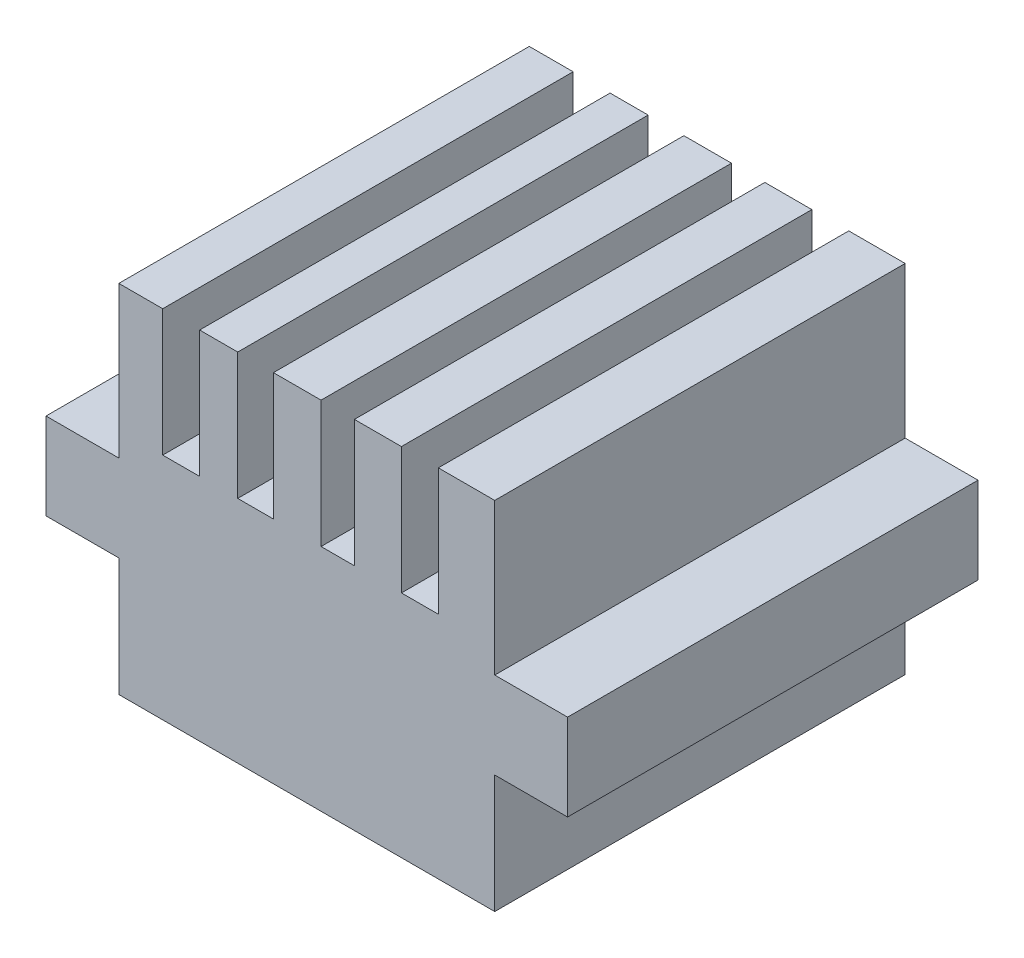
ISO-10303-21;
HEADER;
FILE_DESCRIPTION(('STEP AP214'),'2;1');
FILE_NAME('part.step','',(''),(''),'','','');
FILE_SCHEMA(('AUTOMOTIVE_DESIGN { 1 0 10303 214 1 1 1 1 }'));
ENDSEC;
DATA;
#1=APPLICATION_CONTEXT('core data for automotive mechanical design processes');
#2=APPLICATION_PROTOCOL_DEFINITION('international standard','automotive_design',2000,#1);
#3=PRODUCT_CONTEXT('',#1,'mechanical');
#4=PRODUCT('Part','Part','',(#3));
#5=PRODUCT_RELATED_PRODUCT_CATEGORY('part','',(#4));
#6=PRODUCT_DEFINITION_FORMATION('','',#4);
#7=PRODUCT_DEFINITION_CONTEXT('part definition',#1,'design');
#8=PRODUCT_DEFINITION('design','',#6,#7);
#9=PRODUCT_DEFINITION_SHAPE('','',#8);
#10=(LENGTH_UNIT() NAMED_UNIT(*) SI_UNIT(.MILLI.,.METRE.));
#11=(NAMED_UNIT(*) PLANE_ANGLE_UNIT() SI_UNIT($,.RADIAN.));
#12=(NAMED_UNIT(*) SI_UNIT($,.STERADIAN.) SOLID_ANGLE_UNIT());
#13=UNCERTAINTY_MEASURE_WITH_UNIT(LENGTH_MEASURE(1.E-05),#10,'distance_accuracy_value','');
#14=(GEOMETRIC_REPRESENTATION_CONTEXT(3) GLOBAL_UNCERTAINTY_ASSIGNED_CONTEXT((#13)) GLOBAL_UNIT_ASSIGNED_CONTEXT((#10,
#11,#12)) REPRESENTATION_CONTEXT('',''));
#15=CARTESIAN_POINT('',(0.,0.,0.));
#16=DIRECTION('',(0.,0.,1.));
#17=DIRECTION('',(1.,0.,0.));
#18=AXIS2_PLACEMENT_3D('',#15,#16,#17);
#19=CARTESIAN_POINT('',(28.85,17.6,0.));
#20=DIRECTION('',(-1.,0.,0.));
#21=DIRECTION('',(0.,0.,1.));
#22=AXIS2_PLACEMENT_3D('',#19,#20,#21);
#23=PLANE('',#22);
#24=DIRECTION('',(0.,0.,1.));
#25=VECTOR('',#24,1.);
#26=CARTESIAN_POINT('',(28.85,15.72,0.));
#27=LINE('',#26,#25);
#28=CARTESIAN_POINT('',(28.85,15.72,-31.5));
#29=VERTEX_POINT('',#28);
#30=CARTESIAN_POINT('',(28.85,15.72,0.));
#31=VERTEX_POINT('',#30);
#32=EDGE_CURVE('E240',#29,#31,#27,.T.);
#33=ORIENTED_EDGE('',*,*,#32,.F.);
#34=DIRECTION('',(0.,-1.,0.));
#35=VECTOR('',#34,1.);
#36=CARTESIAN_POINT('',(28.85,17.6,-31.5));
#37=LINE('',#36,#35);
#38=CARTESIAN_POINT('',(28.85,27.33,-31.5));
#39=VERTEX_POINT('',#38);
#40=EDGE_CURVE('E419',#39,#29,#37,.T.);
#41=ORIENTED_EDGE('',*,*,#40,.F.);
#42=DIRECTION('',(0.,0.,-1.));
#43=VECTOR('',#42,1.);
#44=CARTESIAN_POINT('',(28.85,27.33,-31.5));
#45=LINE('',#44,#43);
#46=CARTESIAN_POINT('',(28.85,27.33,0.));
#47=VERTEX_POINT('',#46);
#48=EDGE_CURVE('E369',#47,#39,#45,.T.);
#49=ORIENTED_EDGE('',*,*,#48,.F.);
#50=DIRECTION('',(0.,-1.,0.));
#51=VECTOR('',#50,1.);
#52=CARTESIAN_POINT('',(28.85,17.6,0.));
#53=LINE('',#52,#51);
#54=EDGE_CURVE('E59',#47,#31,#53,.T.);
#55=ORIENTED_EDGE('',*,*,#54,.T.);
#56=EDGE_LOOP('',(#33,#41,#49,#55));
#57=FACE_BOUND('',#56,.T.);
#58=ADVANCED_FACE('F36',(#57),#23,.F.);
#59=DIRECTION('',(0.,0.,-1.));
#60=VECTOR('',#59,1.);
#61=CARTESIAN_POINT('',(28.85,9.08,0.));
#62=LINE('',#61,#60);
#63=CARTESIAN_POINT('',(28.85,9.08,0.));
#64=VERTEX_POINT('',#63);
#65=CARTESIAN_POINT('',(28.85,9.08,-31.5));
#66=VERTEX_POINT('',#65);
#67=EDGE_CURVE('E51',#64,#66,#62,.T.);
#68=ORIENTED_EDGE('',*,*,#67,.F.);
#69=CARTESIAN_POINT('',(28.85,0.,0.));
#70=VERTEX_POINT('',#69);
#71=EDGE_CURVE('E244',#64,#70,#53,.T.);
#72=ORIENTED_EDGE('',*,*,#71,.T.);
#73=DIRECTION('',(0.,0.,-1.));
#74=VECTOR('',#73,1.);
#75=CARTESIAN_POINT('',(28.85,0.,0.));
#76=LINE('',#75,#74);
#77=CARTESIAN_POINT('',(28.85,0.,-31.5));
#78=VERTEX_POINT('',#77);
#79=EDGE_CURVE('E410',#70,#78,#76,.T.);
#80=ORIENTED_EDGE('',*,*,#79,.T.);
#81=EDGE_CURVE('E418',#66,#78,#37,.T.);
#82=ORIENTED_EDGE('',*,*,#81,.F.);
#83=EDGE_LOOP('',(#68,#72,#80,#82));
#84=FACE_BOUND('',#83,.T.);
#85=ADVANCED_FACE('F421',(#84),#23,.F.);
#86=CARTESIAN_POINT('',(0.,17.6,0.));
#87=DIRECTION('',(1.,0.,0.));
#88=DIRECTION('',(0.,0.,-1.));
#89=AXIS2_PLACEMENT_3D('',#86,#87,#88);
#90=PLANE('',#89);
#91=DIRECTION('',(0.,0.,-1.));
#92=VECTOR('',#91,1.);
#93=CARTESIAN_POINT('',(0.,15.72,-31.5));
#94=LINE('',#93,#92);
#95=CARTESIAN_POINT('',(0.,15.72,0.));
#96=VERTEX_POINT('',#95);
#97=CARTESIAN_POINT('',(0.,15.72,-31.5));
#98=VERTEX_POINT('',#97);
#99=EDGE_CURVE('E248',#96,#98,#94,.T.);
#100=ORIENTED_EDGE('',*,*,#99,.F.);
#101=DIRECTION('',(0.,-1.,0.));
#102=VECTOR('',#101,1.);
#103=CARTESIAN_POINT('',(0.,17.6,0.));
#104=LINE('',#103,#102);
#105=CARTESIAN_POINT('',(0.,27.33,0.));
#106=VERTEX_POINT('',#105);
#107=EDGE_CURVE('E11',#106,#96,#104,.T.);
#108=ORIENTED_EDGE('',*,*,#107,.F.);
#109=DIRECTION('',(0.,0.,1.));
#110=VECTOR('',#109,1.);
#111=CARTESIAN_POINT('',(0.,27.33,-31.5));
#112=LINE('',#111,#110);
#113=CARTESIAN_POINT('',(0.,27.33,-31.5));
#114=VERTEX_POINT('',#113);
#115=EDGE_CURVE('E378',#114,#106,#112,.T.);
#116=ORIENTED_EDGE('',*,*,#115,.F.);
#117=DIRECTION('',(0.,-1.,0.));
#118=VECTOR('',#117,1.);
#119=CARTESIAN_POINT('',(0.,17.6,-31.5));
#120=LINE('',#119,#118);
#121=EDGE_CURVE('E416',#114,#98,#120,.T.);
#122=ORIENTED_EDGE('',*,*,#121,.T.);
#123=EDGE_LOOP('',(#100,#108,#116,#122));
#124=FACE_BOUND('',#123,.T.);
#125=ADVANCED_FACE('F38',(#124),#90,.F.);
#126=DIRECTION('',(0.,0.,1.));
#127=VECTOR('',#126,1.);
#128=CARTESIAN_POINT('',(0.,9.08,-31.5));
#129=LINE('',#128,#127);
#130=CARTESIAN_POINT('',(0.,9.08,-31.5));
#131=VERTEX_POINT('',#130);
#132=CARTESIAN_POINT('',(0.,9.08,0.));
#133=VERTEX_POINT('',#132);
#134=EDGE_CURVE('E245',#131,#133,#129,.T.);
#135=ORIENTED_EDGE('',*,*,#134,.F.);
#136=CARTESIAN_POINT('',(0.,0.,-31.5));
#137=VERTEX_POINT('',#136);
#138=EDGE_CURVE('E404',#131,#137,#120,.T.);
#139=ORIENTED_EDGE('',*,*,#138,.T.);
#140=DIRECTION('',(0.,0.,1.));
#141=VECTOR('',#140,1.);
#142=CARTESIAN_POINT('',(0.,0.,0.));
#143=LINE('',#142,#141);
#144=CARTESIAN_POINT('',(0.,0.,0.));
#145=VERTEX_POINT('',#144);
#146=EDGE_CURVE('E396',#137,#145,#143,.T.);
#147=ORIENTED_EDGE('',*,*,#146,.T.);
#148=EDGE_CURVE('E44',#133,#145,#104,.T.);
#149=ORIENTED_EDGE('',*,*,#148,.F.);
#150=EDGE_LOOP('',(#135,#139,#147,#149));
#151=FACE_BOUND('',#150,.T.);
#152=ADVANCED_FACE('F533',(#151),#90,.F.);
#153=CARTESIAN_POINT('',(0.,17.6,0.));
#154=DIRECTION('',(0.,-1.,0.));
#155=DIRECTION('',(0.,0.,-1.));
#156=AXIS2_PLACEMENT_3D('',#153,#154,#155);
#157=PLANE('',#156);
#158=DIRECTION('',(0.,0.,-1.));
#159=VECTOR('',#158,1.);
#160=CARTESIAN_POINT('',(9.12517133066819,17.6,-31.5));
#161=LINE('',#160,#159);
#162=CARTESIAN_POINT('',(9.12517133066819,17.6,0.));
#163=VERTEX_POINT('',#162);
#164=CARTESIAN_POINT('',(9.12517133066819,17.6,-31.5));
#165=VERTEX_POINT('',#164);
#166=EDGE_CURVE('E293',#163,#165,#161,.T.);
#167=ORIENTED_EDGE('',*,*,#166,.F.);
#168=DIRECTION('',(1.,0.,0.));
#169=VECTOR('',#168,1.);
#170=CARTESIAN_POINT('',(0.,17.6,0.));
#171=LINE('',#170,#169);
#172=CARTESIAN_POINT('',(11.8664620217019,17.6,0.));
#173=VERTEX_POINT('',#172);
#174=EDGE_CURVE('E400',#163,#173,#171,.T.);
#175=ORIENTED_EDGE('',*,*,#174,.T.);
#176=DIRECTION('',(0.,0.,1.));
#177=VECTOR('',#176,1.);
#178=CARTESIAN_POINT('',(11.8664620217019,17.6,-31.5));
#179=LINE('',#178,#177);
#180=CARTESIAN_POINT('',(11.8664620217019,17.6,-31.5));
#181=VERTEX_POINT('',#180);
#182=EDGE_CURVE('E317',#181,#173,#179,.T.);
#183=ORIENTED_EDGE('',*,*,#182,.F.);
#184=DIRECTION('',(-1.,0.,0.));
#185=VECTOR('',#184,1.);
#186=CARTESIAN_POINT('',(0.,17.6,-31.5));
#187=LINE('',#186,#185);
#188=EDGE_CURVE('E476',#181,#165,#187,.T.);
#189=ORIENTED_EDGE('',*,*,#188,.T.);
#190=EDGE_LOOP('',(#167,#175,#183,#189));
#191=FACE_BOUND('',#190,.T.);
#192=ADVANCED_FACE('F463',(#191),#157,.F.);
#193=DIRECTION('',(0.,0.,1.));
#194=VECTOR('',#193,1.);
#195=CARTESIAN_POINT('',(6.20112792689892,17.6,-31.5));
#196=LINE('',#195,#194);
#197=CARTESIAN_POINT('',(6.20112792689892,17.6,-31.5));
#198=VERTEX_POINT('',#197);
#199=CARTESIAN_POINT('',(6.20112792689892,17.6,0.));
#200=VERTEX_POINT('',#199);
#201=EDGE_CURVE('E290',#198,#200,#196,.T.);
#202=ORIENTED_EDGE('',*,*,#201,.F.);
#203=CARTESIAN_POINT('',(3.36846087949743,17.6,-31.5));
#204=VERTEX_POINT('',#203);
#205=EDGE_CURVE('E399',#198,#204,#187,.T.);
#206=ORIENTED_EDGE('',*,*,#205,.T.);
#207=DIRECTION('',(0.,0.,-1.));
#208=VECTOR('',#207,1.);
#209=CARTESIAN_POINT('',(3.36846087949743,17.6,-31.5));
#210=LINE('',#209,#208);
#211=CARTESIAN_POINT('',(3.36846087949743,17.6,0.));
#212=VERTEX_POINT('',#211);
#213=EDGE_CURVE('E368',#212,#204,#210,.T.);
#214=ORIENTED_EDGE('',*,*,#213,.F.);
#215=EDGE_CURVE('E397',#212,#200,#171,.T.);
#216=ORIENTED_EDGE('',*,*,#215,.T.);
#217=EDGE_LOOP('',(#202,#206,#214,#216));
#218=FACE_BOUND('',#217,.T.);
#219=ADVANCED_FACE('F480',(#218),#157,.F.);
#220=DIRECTION('',(0.,0.,-1.));
#221=VECTOR('',#220,1.);
#222=CARTESIAN_POINT('',(15.5215162764135,17.6,-31.5));
#223=LINE('',#222,#221);
#224=CARTESIAN_POINT('',(15.5215162764135,17.6,0.));
#225=VERTEX_POINT('',#224);
#226=CARTESIAN_POINT('',(15.5215162764135,17.6,-31.5));
#227=VERTEX_POINT('',#226);
#228=EDGE_CURVE('E320',#225,#227,#223,.T.);
#229=ORIENTED_EDGE('',*,*,#228,.F.);
#230=CARTESIAN_POINT('',(18.0800542547116,17.6,0.));
#231=VERTEX_POINT('',#230);
#232=EDGE_CURVE('E456',#225,#231,#171,.T.);
#233=ORIENTED_EDGE('',*,*,#232,.T.);
#234=DIRECTION('',(0.,0.,1.));
#235=VECTOR('',#234,1.);
#236=CARTESIAN_POINT('',(18.0800542547116,17.6,-31.5));
#237=LINE('',#236,#235);
#238=CARTESIAN_POINT('',(18.0800542547116,17.6,-31.5));
#239=VERTEX_POINT('',#238);
#240=EDGE_CURVE('E344',#239,#231,#237,.T.);
#241=ORIENTED_EDGE('',*,*,#240,.F.);
#242=EDGE_CURVE('E405',#239,#227,#187,.T.);
#243=ORIENTED_EDGE('',*,*,#242,.T.);
#244=EDGE_LOOP('',(#229,#233,#241,#243));
#245=FACE_BOUND('',#244,.T.);
#246=ADVANCED_FACE('F526',(#245),#157,.F.);
#247=DIRECTION('',(0.,0.,-1.));
#248=VECTOR('',#247,1.);
#249=CARTESIAN_POINT('',(21.6894203312393,17.6,-31.5));
#250=LINE('',#249,#248);
#251=CARTESIAN_POINT('',(21.6894203312393,17.6,0.));
#252=VERTEX_POINT('',#251);
#253=CARTESIAN_POINT('',(21.6894203312393,17.6,-31.5));
#254=VERTEX_POINT('',#253);
#255=EDGE_CURVE('E347',#252,#254,#250,.T.);
#256=ORIENTED_EDGE('',*,*,#255,.F.);
#257=CARTESIAN_POINT('',(24.5220873786408,17.6,0.));
#258=VERTEX_POINT('',#257);
#259=EDGE_CURVE('E401',#252,#258,#171,.T.);
#260=ORIENTED_EDGE('',*,*,#259,.T.);
#261=DIRECTION('',(0.,0.,1.));
#262=VECTOR('',#261,1.);
#263=CARTESIAN_POINT('',(24.5220873786408,17.6,-31.5));
#264=LINE('',#263,#262);
#265=CARTESIAN_POINT('',(24.5220873786408,17.6,-31.5));
#266=VERTEX_POINT('',#265);
#267=EDGE_CURVE('E365',#266,#258,#264,.T.);
#268=ORIENTED_EDGE('',*,*,#267,.F.);
#269=EDGE_CURVE('E402',#266,#254,#187,.T.);
#270=ORIENTED_EDGE('',*,*,#269,.T.);
#271=EDGE_LOOP('',(#256,#260,#268,#270));
#272=FACE_BOUND('',#271,.T.);
#273=ADVANCED_FACE('F455',(#272),#157,.F.);
#274=CARTESIAN_POINT('',(0.,17.6,0.));
#275=DIRECTION('',(0.,0.,-1.));
#276=DIRECTION('',(-1.,0.,0.));
#277=AXIS2_PLACEMENT_3D('',#274,#275,#276);
#278=PLANE('',#277);
#279=DIRECTION('',(1.,0.,0.));
#280=VECTOR('',#279,1.);
#281=CARTESIAN_POINT('',(0.,0.,0.));
#282=LINE('',#281,#280);
#283=EDGE_CURVE('E408',#145,#70,#282,.T.);
#284=ORIENTED_EDGE('',*,*,#283,.T.);
#285=ORIENTED_EDGE('',*,*,#71,.F.);
#286=DIRECTION('',(-1.,0.,0.));
#287=VECTOR('',#286,1.);
#288=CARTESIAN_POINT('',(34.44,9.08,0.));
#289=LINE('',#288,#287);
#290=CARTESIAN_POINT('',(34.44,9.08,0.));
#291=VERTEX_POINT('',#290);
#292=EDGE_CURVE('E225',#291,#64,#289,.T.);
#293=ORIENTED_EDGE('',*,*,#292,.F.);
#294=DIRECTION('',(0.,-1.,0.));
#295=VECTOR('',#294,1.);
#296=CARTESIAN_POINT('',(34.44,15.72,0.));
#297=LINE('',#296,#295);
#298=CARTESIAN_POINT('',(34.44,15.72,0.));
#299=VERTEX_POINT('',#298);
#300=EDGE_CURVE('E231',#299,#291,#297,.T.);
#301=ORIENTED_EDGE('',*,*,#300,.F.);
#302=DIRECTION('',(-1.,0.,0.));
#303=VECTOR('',#302,1.);
#304=CARTESIAN_POINT('',(34.44,15.72,0.));
#305=LINE('',#304,#303);
#306=EDGE_CURVE('E437',#299,#31,#305,.T.);
#307=ORIENTED_EDGE('',*,*,#306,.T.);
#308=ORIENTED_EDGE('',*,*,#54,.F.);
#309=DIRECTION('',(1.,0.,0.));
#310=VECTOR('',#309,1.);
#311=CARTESIAN_POINT('',(28.85,27.33,0.));
#312=LINE('',#311,#310);
#313=CARTESIAN_POINT('',(24.5220873786408,27.33,0.));
#314=VERTEX_POINT('',#313);
#315=EDGE_CURVE('E364',#314,#47,#312,.T.);
#316=ORIENTED_EDGE('',*,*,#315,.F.);
#317=DIRECTION('',(0.,-1.,0.));
#318=VECTOR('',#317,1.);
#319=CARTESIAN_POINT('',(24.5220873786408,27.33,0.));
#320=LINE('',#319,#318);
#321=EDGE_CURVE('E361',#314,#258,#320,.T.);
#322=ORIENTED_EDGE('',*,*,#321,.T.);
#323=ORIENTED_EDGE('',*,*,#259,.F.);
#324=DIRECTION('',(0.,-1.,0.));
#325=VECTOR('',#324,1.);
#326=CARTESIAN_POINT('',(21.6894203312393,27.33,0.));
#327=LINE('',#326,#325);
#328=CARTESIAN_POINT('',(21.6894203312393,27.33,0.));
#329=VERTEX_POINT('',#328);
#330=EDGE_CURVE('E340',#329,#252,#327,.T.);
#331=ORIENTED_EDGE('',*,*,#330,.F.);
#332=DIRECTION('',(1.,0.,0.));
#333=VECTOR('',#332,1.);
#334=CARTESIAN_POINT('',(21.6894203312393,27.33,0.));
#335=LINE('',#334,#333);
#336=CARTESIAN_POINT('',(18.0800542547116,27.33,0.));
#337=VERTEX_POINT('',#336);
#338=EDGE_CURVE('E343',#337,#329,#335,.T.);
#339=ORIENTED_EDGE('',*,*,#338,.F.);
#340=DIRECTION('',(0.,-1.,0.));
#341=VECTOR('',#340,1.);
#342=CARTESIAN_POINT('',(18.0800542547116,27.33,0.));
#343=LINE('',#342,#341);
#344=EDGE_CURVE('E337',#337,#231,#343,.T.);
#345=ORIENTED_EDGE('',*,*,#344,.T.);
#346=ORIENTED_EDGE('',*,*,#232,.F.);
#347=DIRECTION('',(0.,-1.,0.));
#348=VECTOR('',#347,1.);
#349=CARTESIAN_POINT('',(15.5215162764135,27.33,0.));
#350=LINE('',#349,#348);
#351=CARTESIAN_POINT('',(15.5215162764135,27.33,0.));
#352=VERTEX_POINT('',#351);
#353=EDGE_CURVE('E313',#352,#225,#350,.T.);
#354=ORIENTED_EDGE('',*,*,#353,.F.);
#355=DIRECTION('',(1.,0.,0.));
#356=VECTOR('',#355,1.);
#357=CARTESIAN_POINT('',(15.5215162764135,27.33,0.));
#358=LINE('',#357,#356);
#359=CARTESIAN_POINT('',(11.8664620217019,27.33,0.));
#360=VERTEX_POINT('',#359);
#361=EDGE_CURVE('E316',#360,#352,#358,.T.);
#362=ORIENTED_EDGE('',*,*,#361,.F.);
#363=DIRECTION('',(0.,-1.,0.));
#364=VECTOR('',#363,1.);
#365=CARTESIAN_POINT('',(11.8664620217019,27.33,0.));
#366=LINE('',#365,#364);
#367=EDGE_CURVE('E310',#360,#173,#366,.T.);
#368=ORIENTED_EDGE('',*,*,#367,.T.);
#369=ORIENTED_EDGE('',*,*,#174,.F.);
#370=DIRECTION('',(0.,-1.,0.));
#371=VECTOR('',#370,1.);
#372=CARTESIAN_POINT('',(9.12517133066819,27.33,0.));
#373=LINE('',#372,#371);
#374=CARTESIAN_POINT('',(9.12517133066819,27.33,0.));
#375=VERTEX_POINT('',#374);
#376=EDGE_CURVE('E286',#375,#163,#373,.T.);
#377=ORIENTED_EDGE('',*,*,#376,.F.);
#378=DIRECTION('',(1.,0.,0.));
#379=VECTOR('',#378,1.);
#380=CARTESIAN_POINT('',(9.12517133066819,27.33,0.));
#381=LINE('',#380,#379);
#382=CARTESIAN_POINT('',(6.20112792689892,27.33,0.));
#383=VERTEX_POINT('',#382);
#384=EDGE_CURVE('E289',#383,#375,#381,.T.);
#385=ORIENTED_EDGE('',*,*,#384,.F.);
#386=DIRECTION('',(0.,-1.,0.));
#387=VECTOR('',#386,1.);
#388=CARTESIAN_POINT('',(6.20112792689892,27.33,0.));
#389=LINE('',#388,#387);
#390=EDGE_CURVE('E283',#383,#200,#389,.T.);
#391=ORIENTED_EDGE('',*,*,#390,.T.);
#392=ORIENTED_EDGE('',*,*,#215,.F.);
#393=DIRECTION('',(0.,-1.,0.));
#394=VECTOR('',#393,1.);
#395=CARTESIAN_POINT('',(3.36846087949743,27.33,0.));
#396=LINE('',#395,#394);
#397=CARTESIAN_POINT('',(3.36846087949743,27.33,0.));
#398=VERTEX_POINT('',#397);
#399=EDGE_CURVE('E393',#398,#212,#396,.T.);
#400=ORIENTED_EDGE('',*,*,#399,.F.);
#401=DIRECTION('',(1.,0.,0.));
#402=VECTOR('',#401,1.);
#403=CARTESIAN_POINT('',(0.,27.33,0.));
#404=LINE('',#403,#402);
#405=EDGE_CURVE('E381',#106,#398,#404,.T.);
#406=ORIENTED_EDGE('',*,*,#405,.F.);
#407=ORIENTED_EDGE('',*,*,#107,.T.);
#408=DIRECTION('',(1.,0.,0.));
#409=VECTOR('',#408,1.);
#410=CARTESIAN_POINT('',(-5.59,15.72,0.));
#411=LINE('',#410,#409);
#412=CARTESIAN_POINT('',(-5.59,15.72,0.));
#413=VERTEX_POINT('',#412);
#414=EDGE_CURVE('E268',#413,#96,#411,.T.);
#415=ORIENTED_EDGE('',*,*,#414,.F.);
#416=DIRECTION('',(0.,1.,0.));
#417=VECTOR('',#416,1.);
#418=CARTESIAN_POINT('',(-5.59,9.08,0.));
#419=LINE('',#418,#417);
#420=CARTESIAN_POINT('',(-5.59,9.08,0.));
#421=VERTEX_POINT('',#420);
#422=EDGE_CURVE('E259',#421,#413,#419,.T.);
#423=ORIENTED_EDGE('',*,*,#422,.F.);
#424=DIRECTION('',(1.,0.,0.));
#425=VECTOR('',#424,1.);
#426=CARTESIAN_POINT('',(-5.59,9.08,0.));
#427=LINE('',#426,#425);
#428=EDGE_CURVE('E271',#421,#133,#427,.T.);
#429=ORIENTED_EDGE('',*,*,#428,.T.);
#430=ORIENTED_EDGE('',*,*,#148,.T.);
#431=EDGE_LOOP('',(#284,#285,#293,#301,#307,#308,#316,#322,#323,#331,#339,#345,#346,#354,#362,
#368,#369,#377,#385,#391,#392,#400,#406,#407,#415,#423,#429,#430));
#432=FACE_BOUND('',#431,.T.);
#433=ADVANCED_FACE('F243',(#432),#278,.F.);
#434=CARTESIAN_POINT('',(0.,17.6,-31.5));
#435=DIRECTION('',(0.,0.,1.));
#436=DIRECTION('',(1.,0.,0.));
#437=AXIS2_PLACEMENT_3D('',#434,#435,#436);
#438=PLANE('',#437);
#439=DIRECTION('',(-1.,0.,0.));
#440=VECTOR('',#439,1.);
#441=CARTESIAN_POINT('',(0.,0.,-31.5));
#442=LINE('',#441,#440);
#443=EDGE_CURVE('E413',#78,#137,#442,.T.);
#444=ORIENTED_EDGE('',*,*,#443,.T.);
#445=ORIENTED_EDGE('',*,*,#138,.F.);
#446=DIRECTION('',(1.,0.,0.));
#447=VECTOR('',#446,1.);
#448=CARTESIAN_POINT('',(-5.59,9.08,-31.5));
#449=LINE('',#448,#447);
#450=CARTESIAN_POINT('',(-5.59,9.08,-31.5));
#451=VERTEX_POINT('',#450);
#452=EDGE_CURVE('E274',#451,#131,#449,.T.);
#453=ORIENTED_EDGE('',*,*,#452,.F.);
#454=DIRECTION('',(0.,-1.,0.));
#455=VECTOR('',#454,1.);
#456=CARTESIAN_POINT('',(-5.59,9.08,-31.5));
#457=LINE('',#456,#455);
#458=CARTESIAN_POINT('',(-5.59,15.72,-31.5));
#459=VERTEX_POINT('',#458);
#460=EDGE_CURVE('E254',#459,#451,#457,.T.);
#461=ORIENTED_EDGE('',*,*,#460,.F.);
#462=DIRECTION('',(1.,0.,0.));
#463=VECTOR('',#462,1.);
#464=CARTESIAN_POINT('',(-5.59,15.72,-31.5));
#465=LINE('',#464,#463);
#466=EDGE_CURVE('E262',#459,#98,#465,.T.);
#467=ORIENTED_EDGE('',*,*,#466,.T.);
#468=ORIENTED_EDGE('',*,*,#121,.F.);
#469=DIRECTION('',(-1.,0.,0.));
#470=VECTOR('',#469,1.);
#471=CARTESIAN_POINT('',(0.,27.33,-31.5));
#472=LINE('',#471,#470);
#473=CARTESIAN_POINT('',(3.36846087949743,27.33,-31.5));
#474=VERTEX_POINT('',#473);
#475=EDGE_CURVE('E385',#474,#114,#472,.T.);
#476=ORIENTED_EDGE('',*,*,#475,.F.);
#477=DIRECTION('',(0.,-1.,0.));
#478=VECTOR('',#477,1.);
#479=CARTESIAN_POINT('',(3.36846087949743,27.33,-31.5));
#480=LINE('',#479,#478);
#481=EDGE_CURVE('E388',#474,#204,#480,.T.);
#482=ORIENTED_EDGE('',*,*,#481,.T.);
#483=ORIENTED_EDGE('',*,*,#205,.F.);
#484=DIRECTION('',(0.,-1.,0.));
#485=VECTOR('',#484,1.);
#486=CARTESIAN_POINT('',(6.20112792689892,27.33,-31.5));
#487=LINE('',#486,#485);
#488=CARTESIAN_POINT('',(6.20112792689892,27.33,-31.5));
#489=VERTEX_POINT('',#488);
#490=EDGE_CURVE('E280',#489,#198,#487,.T.);
#491=ORIENTED_EDGE('',*,*,#490,.F.);
#492=DIRECTION('',(-1.,0.,0.));
#493=VECTOR('',#492,1.);
#494=CARTESIAN_POINT('',(9.12517133066819,27.33,-31.5));
#495=LINE('',#494,#493);
#496=CARTESIAN_POINT('',(9.12517133066819,27.33,-31.5));
#497=VERTEX_POINT('',#496);
#498=EDGE_CURVE('E301',#497,#489,#495,.T.);
#499=ORIENTED_EDGE('',*,*,#498,.F.);
#500=DIRECTION('',(0.,-1.,0.));
#501=VECTOR('',#500,1.);
#502=CARTESIAN_POINT('',(9.12517133066819,27.33,-31.5));
#503=LINE('',#502,#501);
#504=EDGE_CURVE('E277',#497,#165,#503,.T.);
#505=ORIENTED_EDGE('',*,*,#504,.T.);
#506=ORIENTED_EDGE('',*,*,#188,.F.);
#507=DIRECTION('',(0.,-1.,0.));
#508=VECTOR('',#507,1.);
#509=CARTESIAN_POINT('',(11.8664620217019,27.33,-31.5));
#510=LINE('',#509,#508);
#511=CARTESIAN_POINT('',(11.8664620217019,27.33,-31.5));
#512=VERTEX_POINT('',#511);
#513=EDGE_CURVE('E307',#512,#181,#510,.T.);
#514=ORIENTED_EDGE('',*,*,#513,.F.);
#515=DIRECTION('',(-1.,0.,0.));
#516=VECTOR('',#515,1.);
#517=CARTESIAN_POINT('',(15.5215162764135,27.33,-31.5));
#518=LINE('',#517,#516);
#519=CARTESIAN_POINT('',(15.5215162764135,27.33,-31.5));
#520=VERTEX_POINT('',#519);
#521=EDGE_CURVE('E328',#520,#512,#518,.T.);
#522=ORIENTED_EDGE('',*,*,#521,.F.);
#523=DIRECTION('',(0.,-1.,0.));
#524=VECTOR('',#523,1.);
#525=CARTESIAN_POINT('',(15.5215162764135,27.33,-31.5));
#526=LINE('',#525,#524);
#527=EDGE_CURVE('E297',#520,#227,#526,.T.);
#528=ORIENTED_EDGE('',*,*,#527,.T.);
#529=ORIENTED_EDGE('',*,*,#242,.F.);
#530=DIRECTION('',(0.,-1.,0.));
#531=VECTOR('',#530,1.);
#532=CARTESIAN_POINT('',(18.0800542547116,27.33,-31.5));
#533=LINE('',#532,#531);
#534=CARTESIAN_POINT('',(18.0800542547116,27.33,-31.5));
#535=VERTEX_POINT('',#534);
#536=EDGE_CURVE('E334',#535,#239,#533,.T.);
#537=ORIENTED_EDGE('',*,*,#536,.F.);
#538=DIRECTION('',(-1.,0.,0.));
#539=VECTOR('',#538,1.);
#540=CARTESIAN_POINT('',(21.6894203312393,27.33,-31.5));
#541=LINE('',#540,#539);
#542=CARTESIAN_POINT('',(21.6894203312393,27.33,-31.5));
#543=VERTEX_POINT('',#542);
#544=EDGE_CURVE('E355',#543,#535,#541,.T.);
#545=ORIENTED_EDGE('',*,*,#544,.F.);
#546=DIRECTION('',(0.,-1.,0.));
#547=VECTOR('',#546,1.);
#548=CARTESIAN_POINT('',(21.6894203312393,27.33,-31.5));
#549=LINE('',#548,#547);
#550=EDGE_CURVE('E324',#543,#254,#549,.T.);
#551=ORIENTED_EDGE('',*,*,#550,.T.);
#552=ORIENTED_EDGE('',*,*,#269,.F.);
#553=DIRECTION('',(0.,-1.,0.));
#554=VECTOR('',#553,1.);
#555=CARTESIAN_POINT('',(24.5220873786408,27.33,-31.5));
#556=LINE('',#555,#554);
#557=CARTESIAN_POINT('',(24.5220873786408,27.33,-31.5));
#558=VERTEX_POINT('',#557);
#559=EDGE_CURVE('E351',#558,#266,#556,.T.);
#560=ORIENTED_EDGE('',*,*,#559,.F.);
#561=DIRECTION('',(-1.,0.,0.));
#562=VECTOR('',#561,1.);
#563=CARTESIAN_POINT('',(28.85,27.33,-31.5));
#564=LINE('',#563,#562);
#565=EDGE_CURVE('E374',#39,#558,#564,.T.);
#566=ORIENTED_EDGE('',*,*,#565,.F.);
#567=ORIENTED_EDGE('',*,*,#40,.T.);
#568=DIRECTION('',(-1.,0.,0.));
#569=VECTOR('',#568,1.);
#570=CARTESIAN_POINT('',(34.44,15.72,-31.5));
#571=LINE('',#570,#569);
#572=CARTESIAN_POINT('',(34.44,15.72,-31.5));
#573=VERTEX_POINT('',#572);
#574=EDGE_CURVE('E250',#573,#29,#571,.T.);
#575=ORIENTED_EDGE('',*,*,#574,.F.);
#576=DIRECTION('',(0.,1.,0.));
#577=VECTOR('',#576,1.);
#578=CARTESIAN_POINT('',(34.44,15.72,-31.5));
#579=LINE('',#578,#577);
#580=CARTESIAN_POINT('',(34.44,9.08,-31.5));
#581=VERTEX_POINT('',#580);
#582=EDGE_CURVE('E230',#581,#573,#579,.T.);
#583=ORIENTED_EDGE('',*,*,#582,.F.);
#584=DIRECTION('',(-1.,0.,0.));
#585=VECTOR('',#584,1.);
#586=CARTESIAN_POINT('',(34.44,9.08,-31.5));
#587=LINE('',#586,#585);
#588=EDGE_CURVE('E227',#581,#66,#587,.T.);
#589=ORIENTED_EDGE('',*,*,#588,.T.);
#590=ORIENTED_EDGE('',*,*,#81,.T.);
#591=EDGE_LOOP('',(#444,#445,#453,#461,#467,#468,#476,#482,#483,#491,#499,#505,#506,#514,#522,
#528,#529,#537,#545,#551,#552,#560,#566,#567,#575,#583,#589,#590));
#592=FACE_BOUND('',#591,.T.);
#593=ADVANCED_FACE('F430',(#592),#438,.F.);
#594=CARTESIAN_POINT('',(0.,0.,0.));
#595=DIRECTION('',(0.,-1.,0.));
#596=DIRECTION('',(0.,0.,-1.));
#597=AXIS2_PLACEMENT_3D('',#594,#595,#596);
#598=PLANE('',#597);
#599=ORIENTED_EDGE('',*,*,#146,.F.);
#600=ORIENTED_EDGE('',*,*,#443,.F.);
#601=ORIENTED_EDGE('',*,*,#79,.F.);
#602=ORIENTED_EDGE('',*,*,#283,.F.);
#603=EDGE_LOOP('',(#599,#600,#601,#602));
#604=FACE_BOUND('',#603,.T.);
#605=ADVANCED_FACE('F427',(#604),#598,.T.);
#606=CARTESIAN_POINT('',(3.36846087949743,27.33,-31.5));
#607=DIRECTION('',(-1.,0.,0.));
#608=DIRECTION('',(0.,0.,1.));
#609=AXIS2_PLACEMENT_3D('',#606,#607,#608);
#610=PLANE('',#609);
#611=ORIENTED_EDGE('',*,*,#213,.T.);
#612=ORIENTED_EDGE('',*,*,#481,.F.);
#613=DIRECTION('',(0.,0.,-1.));
#614=VECTOR('',#613,1.);
#615=CARTESIAN_POINT('',(3.36846087949743,27.33,-31.5));
#616=LINE('',#615,#614);
#617=EDGE_CURVE('E383',#398,#474,#616,.T.);
#618=ORIENTED_EDGE('',*,*,#617,.F.);
#619=ORIENTED_EDGE('',*,*,#399,.T.);
#620=EDGE_LOOP('',(#611,#612,#618,#619));
#621=FACE_BOUND('',#620,.T.);
#622=ADVANCED_FACE('F485',(#621),#610,.F.);
#623=CARTESIAN_POINT('',(0.,27.33,0.));
#624=DIRECTION('',(0.,1.,0.));
#625=DIRECTION('',(0.,0.,1.));
#626=AXIS2_PLACEMENT_3D('',#623,#624,#625);
#627=PLANE('',#626);
#628=ORIENTED_EDGE('',*,*,#115,.T.);
#629=ORIENTED_EDGE('',*,*,#405,.T.);
#630=ORIENTED_EDGE('',*,*,#617,.T.);
#631=ORIENTED_EDGE('',*,*,#475,.T.);
#632=EDGE_LOOP('',(#628,#629,#630,#631));
#633=FACE_BOUND('',#632,.T.);
#634=ADVANCED_FACE('F491',(#633),#627,.T.);
#635=CARTESIAN_POINT('',(24.5220873786408,27.33,-31.5));
#636=DIRECTION('',(1.,0.,0.));
#637=DIRECTION('',(0.,0.,-1.));
#638=AXIS2_PLACEMENT_3D('',#635,#636,#637);
#639=PLANE('',#638);
#640=ORIENTED_EDGE('',*,*,#267,.T.);
#641=ORIENTED_EDGE('',*,*,#321,.F.);
#642=DIRECTION('',(0.,0.,1.));
#643=VECTOR('',#642,1.);
#644=CARTESIAN_POINT('',(24.5220873786408,27.33,-31.5));
#645=LINE('',#644,#643);
#646=EDGE_CURVE('E372',#558,#314,#645,.T.);
#647=ORIENTED_EDGE('',*,*,#646,.F.);
#648=ORIENTED_EDGE('',*,*,#559,.T.);
#649=EDGE_LOOP('',(#640,#641,#647,#648));
#650=FACE_BOUND('',#649,.T.);
#651=ADVANCED_FACE('F452',(#650),#639,.F.);
#652=CARTESIAN_POINT('',(0.,27.33,0.));
#653=DIRECTION('',(0.,-1.,0.));
#654=DIRECTION('',(0.,0.,-1.));
#655=AXIS2_PLACEMENT_3D('',#652,#653,#654);
#656=PLANE('',#655);
#657=ORIENTED_EDGE('',*,*,#48,.T.);
#658=ORIENTED_EDGE('',*,*,#565,.T.);
#659=ORIENTED_EDGE('',*,*,#646,.T.);
#660=ORIENTED_EDGE('',*,*,#315,.T.);
#661=EDGE_LOOP('',(#657,#658,#659,#660));
#662=FACE_BOUND('',#661,.T.);
#663=ADVANCED_FACE('F445',(#662),#656,.F.);
#664=CARTESIAN_POINT('',(21.6894203312393,27.33,-31.5));
#665=DIRECTION('',(-1.,0.,0.));
#666=DIRECTION('',(0.,0.,1.));
#667=AXIS2_PLACEMENT_3D('',#664,#665,#666);
#668=PLANE('',#667);
#669=ORIENTED_EDGE('',*,*,#255,.T.);
#670=ORIENTED_EDGE('',*,*,#550,.F.);
#671=DIRECTION('',(0.,0.,-1.));
#672=VECTOR('',#671,1.);
#673=CARTESIAN_POINT('',(21.6894203312393,27.33,-31.5));
#674=LINE('',#673,#672);
#675=EDGE_CURVE('E348',#329,#543,#674,.T.);
#676=ORIENTED_EDGE('',*,*,#675,.F.);
#677=ORIENTED_EDGE('',*,*,#330,.T.);
#678=EDGE_LOOP('',(#669,#670,#676,#677));
#679=FACE_BOUND('',#678,.T.);
#680=ADVANCED_FACE('F638',(#679),#668,.F.);
#681=CARTESIAN_POINT('',(18.0800542547116,27.33,-31.5));
#682=DIRECTION('',(1.,0.,0.));
#683=DIRECTION('',(0.,0.,-1.));
#684=AXIS2_PLACEMENT_3D('',#681,#682,#683);
#685=PLANE('',#684);
#686=ORIENTED_EDGE('',*,*,#240,.T.);
#687=ORIENTED_EDGE('',*,*,#344,.F.);
#688=DIRECTION('',(0.,0.,1.));
#689=VECTOR('',#688,1.);
#690=CARTESIAN_POINT('',(18.0800542547116,27.33,-31.5));
#691=LINE('',#690,#689);
#692=EDGE_CURVE('E353',#535,#337,#691,.T.);
#693=ORIENTED_EDGE('',*,*,#692,.F.);
#694=ORIENTED_EDGE('',*,*,#536,.T.);
#695=EDGE_LOOP('',(#686,#687,#693,#694));
#696=FACE_BOUND('',#695,.T.);
#697=ADVANCED_FACE('F645',(#696),#685,.F.);
#698=CARTESIAN_POINT('',(0.,27.33,0.));
#699=DIRECTION('',(0.,-1.,0.));
#700=DIRECTION('',(0.,0.,-1.));
#701=AXIS2_PLACEMENT_3D('',#698,#699,#700);
#702=PLANE('',#701);
#703=ORIENTED_EDGE('',*,*,#675,.T.);
#704=ORIENTED_EDGE('',*,*,#544,.T.);
#705=ORIENTED_EDGE('',*,*,#692,.T.);
#706=ORIENTED_EDGE('',*,*,#338,.T.);
#707=EDGE_LOOP('',(#703,#704,#705,#706));
#708=FACE_BOUND('',#707,.T.);
#709=ADVANCED_FACE('F653',(#708),#702,.F.);
#710=CARTESIAN_POINT('',(15.5215162764135,27.33,-31.5));
#711=DIRECTION('',(-1.,0.,0.));
#712=DIRECTION('',(0.,0.,1.));
#713=AXIS2_PLACEMENT_3D('',#710,#711,#712);
#714=PLANE('',#713);
#715=ORIENTED_EDGE('',*,*,#228,.T.);
#716=ORIENTED_EDGE('',*,*,#527,.F.);
#717=DIRECTION('',(0.,0.,-1.));
#718=VECTOR('',#717,1.);
#719=CARTESIAN_POINT('',(15.5215162764135,27.33,-31.5));
#720=LINE('',#719,#718);
#721=EDGE_CURVE('E321',#352,#520,#720,.T.);
#722=ORIENTED_EDGE('',*,*,#721,.F.);
#723=ORIENTED_EDGE('',*,*,#353,.T.);
#724=EDGE_LOOP('',(#715,#716,#722,#723));
#725=FACE_BOUND('',#724,.T.);
#726=ADVANCED_FACE('F661',(#725),#714,.F.);
#727=CARTESIAN_POINT('',(11.8664620217019,27.33,-31.5));
#728=DIRECTION('',(1.,0.,0.));
#729=DIRECTION('',(0.,0.,-1.));
#730=AXIS2_PLACEMENT_3D('',#727,#728,#729);
#731=PLANE('',#730);
#732=ORIENTED_EDGE('',*,*,#182,.T.);
#733=ORIENTED_EDGE('',*,*,#367,.F.);
#734=DIRECTION('',(0.,0.,1.));
#735=VECTOR('',#734,1.);
#736=CARTESIAN_POINT('',(11.8664620217019,27.33,-31.5));
#737=LINE('',#736,#735);
#738=EDGE_CURVE('E326',#512,#360,#737,.T.);
#739=ORIENTED_EDGE('',*,*,#738,.F.);
#740=ORIENTED_EDGE('',*,*,#513,.T.);
#741=EDGE_LOOP('',(#732,#733,#739,#740));
#742=FACE_BOUND('',#741,.T.);
#743=ADVANCED_FACE('F467',(#742),#731,.F.);
#744=CARTESIAN_POINT('',(0.,27.33,0.));
#745=DIRECTION('',(0.,-1.,0.));
#746=DIRECTION('',(0.,0.,-1.));
#747=AXIS2_PLACEMENT_3D('',#744,#745,#746);
#748=PLANE('',#747);
#749=ORIENTED_EDGE('',*,*,#721,.T.);
#750=ORIENTED_EDGE('',*,*,#521,.T.);
#751=ORIENTED_EDGE('',*,*,#738,.T.);
#752=ORIENTED_EDGE('',*,*,#361,.T.);
#753=EDGE_LOOP('',(#749,#750,#751,#752));
#754=FACE_BOUND('',#753,.T.);
#755=ADVANCED_FACE('F474',(#754),#748,.F.);
#756=CARTESIAN_POINT('',(9.12517133066819,27.33,-31.5));
#757=DIRECTION('',(-1.,0.,0.));
#758=DIRECTION('',(0.,0.,1.));
#759=AXIS2_PLACEMENT_3D('',#756,#757,#758);
#760=PLANE('',#759);
#761=ORIENTED_EDGE('',*,*,#166,.T.);
#762=ORIENTED_EDGE('',*,*,#504,.F.);
#763=DIRECTION('',(0.,0.,-1.));
#764=VECTOR('',#763,1.);
#765=CARTESIAN_POINT('',(9.12517133066819,27.33,-31.5));
#766=LINE('',#765,#764);
#767=EDGE_CURVE('E294',#375,#497,#766,.T.);
#768=ORIENTED_EDGE('',*,*,#767,.F.);
#769=ORIENTED_EDGE('',*,*,#376,.T.);
#770=EDGE_LOOP('',(#761,#762,#768,#769));
#771=FACE_BOUND('',#770,.T.);
#772=ADVANCED_FACE('F504',(#771),#760,.F.);
#773=CARTESIAN_POINT('',(6.20112792689892,27.33,-31.5));
#774=DIRECTION('',(1.,0.,0.));
#775=DIRECTION('',(0.,0.,-1.));
#776=AXIS2_PLACEMENT_3D('',#773,#774,#775);
#777=PLANE('',#776);
#778=ORIENTED_EDGE('',*,*,#201,.T.);
#779=ORIENTED_EDGE('',*,*,#390,.F.);
#780=DIRECTION('',(0.,0.,1.));
#781=VECTOR('',#780,1.);
#782=CARTESIAN_POINT('',(6.20112792689892,27.33,-31.5));
#783=LINE('',#782,#781);
#784=EDGE_CURVE('E299',#489,#383,#783,.T.);
#785=ORIENTED_EDGE('',*,*,#784,.F.);
#786=ORIENTED_EDGE('',*,*,#490,.T.);
#787=EDGE_LOOP('',(#778,#779,#785,#786));
#788=FACE_BOUND('',#787,.T.);
#789=ADVANCED_FACE('F498',(#788),#777,.F.);
#790=CARTESIAN_POINT('',(0.,27.33,0.));
#791=DIRECTION('',(0.,-1.,0.));
#792=DIRECTION('',(0.,0.,-1.));
#793=AXIS2_PLACEMENT_3D('',#790,#791,#792);
#794=PLANE('',#793);
#795=ORIENTED_EDGE('',*,*,#767,.T.);
#796=ORIENTED_EDGE('',*,*,#498,.T.);
#797=ORIENTED_EDGE('',*,*,#784,.T.);
#798=ORIENTED_EDGE('',*,*,#384,.T.);
#799=EDGE_LOOP('',(#795,#796,#797,#798));
#800=FACE_BOUND('',#799,.T.);
#801=ADVANCED_FACE('F502',(#800),#794,.F.);
#802=CARTESIAN_POINT('',(-5.59,9.08,-31.5));
#803=DIRECTION('',(0.,1.,0.));
#804=DIRECTION('',(0.,0.,1.));
#805=AXIS2_PLACEMENT_3D('',#802,#803,#804);
#806=PLANE('',#805);
#807=ORIENTED_EDGE('',*,*,#134,.T.);
#808=ORIENTED_EDGE('',*,*,#428,.F.);
#809=DIRECTION('',(0.,0.,1.));
#810=VECTOR('',#809,1.);
#811=CARTESIAN_POINT('',(-5.59,9.08,-31.5));
#812=LINE('',#811,#810);
#813=EDGE_CURVE('E257',#451,#421,#812,.T.);
#814=ORIENTED_EDGE('',*,*,#813,.F.);
#815=ORIENTED_EDGE('',*,*,#452,.T.);
#816=EDGE_LOOP('',(#807,#808,#814,#815));
#817=FACE_BOUND('',#816,.T.);
#818=ADVANCED_FACE('F544',(#817),#806,.F.);
#819=CARTESIAN_POINT('',(-5.59,15.72,-31.5));
#820=DIRECTION('',(0.,-1.,0.));
#821=DIRECTION('',(0.,0.,-1.));
#822=AXIS2_PLACEMENT_3D('',#819,#820,#821);
#823=PLANE('',#822);
#824=ORIENTED_EDGE('',*,*,#99,.T.);
#825=ORIENTED_EDGE('',*,*,#466,.F.);
#826=DIRECTION('',(0.,0.,-1.));
#827=VECTOR('',#826,1.);
#828=CARTESIAN_POINT('',(-5.59,15.72,-31.5));
#829=LINE('',#828,#827);
#830=EDGE_CURVE('E261',#413,#459,#829,.T.);
#831=ORIENTED_EDGE('',*,*,#830,.F.);
#832=ORIENTED_EDGE('',*,*,#414,.T.);
#833=EDGE_LOOP('',(#824,#825,#831,#832));
#834=FACE_BOUND('',#833,.T.);
#835=ADVANCED_FACE('F552',(#834),#823,.F.);
#836=CARTESIAN_POINT('',(-5.59,0.,0.));
#837=DIRECTION('',(1.,0.,0.));
#838=DIRECTION('',(0.,0.,-1.));
#839=AXIS2_PLACEMENT_3D('',#836,#837,#838);
#840=PLANE('',#839);
#841=ORIENTED_EDGE('',*,*,#460,.T.);
#842=ORIENTED_EDGE('',*,*,#813,.T.);
#843=ORIENTED_EDGE('',*,*,#422,.T.);
#844=ORIENTED_EDGE('',*,*,#830,.T.);
#845=EDGE_LOOP('',(#841,#842,#843,#844));
#846=FACE_BOUND('',#845,.T.);
#847=ADVANCED_FACE('F548',(#846),#840,.F.);
#848=CARTESIAN_POINT('',(34.44,9.08,0.));
#849=DIRECTION('',(0.,1.,0.));
#850=DIRECTION('',(0.,0.,1.));
#851=AXIS2_PLACEMENT_3D('',#848,#849,#850);
#852=PLANE('',#851);
#853=ORIENTED_EDGE('',*,*,#67,.T.);
#854=ORIENTED_EDGE('',*,*,#588,.F.);
#855=DIRECTION('',(0.,0.,-1.));
#856=VECTOR('',#855,1.);
#857=CARTESIAN_POINT('',(34.44,9.08,0.));
#858=LINE('',#857,#856);
#859=EDGE_CURVE('E221',#291,#581,#858,.T.);
#860=ORIENTED_EDGE('',*,*,#859,.F.);
#861=ORIENTED_EDGE('',*,*,#292,.T.);
#862=EDGE_LOOP('',(#853,#854,#860,#861));
#863=FACE_BOUND('',#862,.T.);
#864=ADVANCED_FACE('F223',(#863),#852,.F.);
#865=CARTESIAN_POINT('',(34.44,15.72,0.));
#866=DIRECTION('',(0.,-1.,0.));
#867=DIRECTION('',(0.,0.,-1.));
#868=AXIS2_PLACEMENT_3D('',#865,#866,#867);
#869=PLANE('',#868);
#870=ORIENTED_EDGE('',*,*,#32,.T.);
#871=ORIENTED_EDGE('',*,*,#306,.F.);
#872=DIRECTION('',(0.,0.,1.));
#873=VECTOR('',#872,1.);
#874=CARTESIAN_POINT('',(34.44,15.72,0.));
#875=LINE('',#874,#873);
#876=EDGE_CURVE('E236',#573,#299,#875,.T.);
#877=ORIENTED_EDGE('',*,*,#876,.F.);
#878=ORIENTED_EDGE('',*,*,#574,.T.);
#879=EDGE_LOOP('',(#870,#871,#877,#878));
#880=FACE_BOUND('',#879,.T.);
#881=ADVANCED_FACE('F441',(#880),#869,.F.);
#882=CARTESIAN_POINT('',(34.44,0.,0.));
#883=DIRECTION('',(1.,0.,0.));
#884=DIRECTION('',(0.,0.,-1.));
#885=AXIS2_PLACEMENT_3D('',#882,#883,#884);
#886=PLANE('',#885);
#887=ORIENTED_EDGE('',*,*,#300,.T.);
#888=ORIENTED_EDGE('',*,*,#859,.T.);
#889=ORIENTED_EDGE('',*,*,#582,.T.);
#890=ORIENTED_EDGE('',*,*,#876,.T.);
#891=EDGE_LOOP('',(#887,#888,#889,#890));
#892=FACE_BOUND('',#891,.T.);
#893=ADVANCED_FACE('F234',(#892),#886,.T.);
#894=CLOSED_SHELL('',(#58,#85,#125,#152,#192,#219,#246,#273,#433,#593,#605,#622,#634,#651,#663,
#680,#697,#709,#726,#743,#755,#772,#789,#801,#818,#835,#847,#864,#881,#893));
#895=MANIFOLD_SOLID_BREP('B2',#894);
#896=ADVANCED_BREP_SHAPE_REPRESENTATION('',(#18,#895),#14);
#897=SHAPE_DEFINITION_REPRESENTATION(#9,#896);
ENDSEC;
END-ISO-10303-21;
